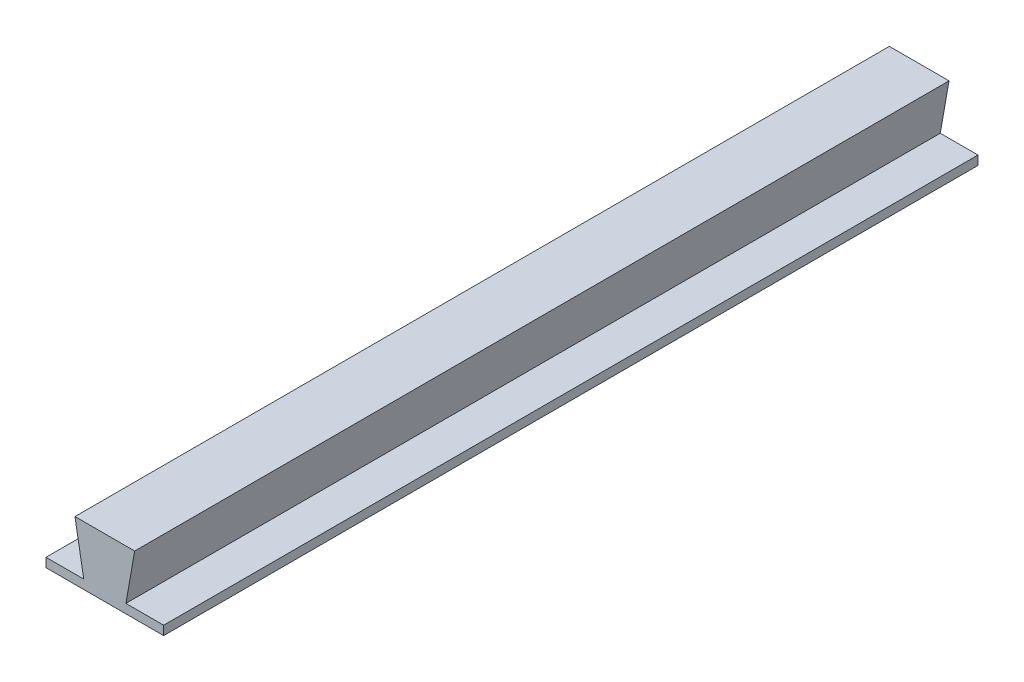
ISO-10303-21;
HEADER;
FILE_DESCRIPTION(('STEP AP214'),'2;1');
FILE_NAME('part.step','',(''),(''),'','','');
FILE_SCHEMA(('AUTOMOTIVE_DESIGN { 1 0 10303 214 1 1 1 1 }'));
ENDSEC;
DATA;
#1=APPLICATION_CONTEXT('core data for automotive mechanical design processes');
#2=APPLICATION_PROTOCOL_DEFINITION('international standard','automotive_design',2000,#1);
#3=PRODUCT_CONTEXT('',#1,'mechanical');
#4=PRODUCT('Part','Part','',(#3));
#5=PRODUCT_RELATED_PRODUCT_CATEGORY('part','',(#4));
#6=PRODUCT_DEFINITION_FORMATION('','',#4);
#7=PRODUCT_DEFINITION_CONTEXT('part definition',#1,'design');
#8=PRODUCT_DEFINITION('design','',#6,#7);
#9=PRODUCT_DEFINITION_SHAPE('','',#8);
#10=(LENGTH_UNIT() NAMED_UNIT(*) SI_UNIT(.MILLI.,.METRE.));
#11=(NAMED_UNIT(*) PLANE_ANGLE_UNIT() SI_UNIT($,.RADIAN.));
#12=(NAMED_UNIT(*) SI_UNIT($,.STERADIAN.) SOLID_ANGLE_UNIT());
#13=UNCERTAINTY_MEASURE_WITH_UNIT(LENGTH_MEASURE(1.E-05),#10,'distance_accuracy_value','');
#14=(GEOMETRIC_REPRESENTATION_CONTEXT(3) GLOBAL_UNCERTAINTY_ASSIGNED_CONTEXT((#13)) GLOBAL_UNIT_ASSIGNED_CONTEXT((#10,
#11,#12)) REPRESENTATION_CONTEXT('',''));
#15=CARTESIAN_POINT('',(0.,0.,0.));
#16=DIRECTION('',(0.,0.,1.));
#17=DIRECTION('',(1.,0.,0.));
#18=AXIS2_PLACEMENT_3D('',#15,#16,#17);
#19=CARTESIAN_POINT('',(-4.51987486030227,-0.796975887297212,180.));
#20=DIRECTION('',(-0.984807753012207,-0.173648177666934,0.));
#21=DIRECTION('',(0.173648177666934,-0.984807753012207,0.));
#22=AXIS2_PLACEMENT_3D('',#19,#20,#21);
#23=PLANE('',#22);
#24=DIRECTION('',(-0.173648177666934,0.984807753012207,0.));
#25=VECTOR('',#24,1.);
#26=CARTESIAN_POINT('',(-4.51987486030227,-0.796975887297212,0.));
#27=LINE('',#26,#25);
#28=CARTESIAN_POINT('',(-4.66040321220684,0.,0.));
#29=VERTEX_POINT('',#28);
#30=CARTESIAN_POINT('',(-6.6,11.,0.));
#31=VERTEX_POINT('',#30);
#32=EDGE_CURVE('E140',#29,#31,#27,.T.);
#33=ORIENTED_EDGE('',*,*,#32,.F.);
#34=DIRECTION('',(0.,0.,-1.));
#35=VECTOR('',#34,1.);
#36=CARTESIAN_POINT('',(-4.66040321220684,0.,180.));
#37=LINE('',#36,#35);
#38=CARTESIAN_POINT('',(-4.66040321220684,0.,180.));
#39=VERTEX_POINT('',#38);
#40=EDGE_CURVE('E11',#39,#29,#37,.T.);
#41=ORIENTED_EDGE('',*,*,#40,.F.);
#42=DIRECTION('',(-0.173648177666934,0.984807753012207,0.));
#43=VECTOR('',#42,1.);
#44=CARTESIAN_POINT('',(-4.51987486030227,-0.796975887297212,180.));
#45=LINE('',#44,#43);
#46=CARTESIAN_POINT('',(-6.6,11.,180.));
#47=VERTEX_POINT('',#46);
#48=EDGE_CURVE('E150',#39,#47,#45,.T.);
#49=ORIENTED_EDGE('',*,*,#48,.T.);
#50=DIRECTION('',(0.,0.,-1.));
#51=VECTOR('',#50,1.);
#52=CARTESIAN_POINT('',(-6.6,11.,180.));
#53=LINE('',#52,#51);
#54=EDGE_CURVE('E79',#47,#31,#53,.T.);
#55=ORIENTED_EDGE('',*,*,#54,.T.);
#56=EDGE_LOOP('',(#33,#41,#49,#55));
#57=FACE_BOUND('',#56,.T.);
#58=ADVANCED_FACE('F41',(#57),#23,.T.);
#59=CARTESIAN_POINT('',(4.51987486030227,-0.796975887297213,180.));
#60=DIRECTION('',(-0.984807753012207,0.173648177666934,0.));
#61=DIRECTION('',(-0.173648177666934,-0.984807753012208,0.));
#62=AXIS2_PLACEMENT_3D('',#59,#60,#61);
#63=PLANE('',#62);
#64=DIRECTION('',(0.173648177666934,0.984807753012208,0.));
#65=VECTOR('',#64,1.);
#66=CARTESIAN_POINT('',(4.51987486030227,-0.796975887297213,0.));
#67=LINE('',#66,#65);
#68=CARTESIAN_POINT('',(4.66040321220684,0.,0.));
#69=VERTEX_POINT('',#68);
#70=CARTESIAN_POINT('',(6.6,11.,0.));
#71=VERTEX_POINT('',#70);
#72=EDGE_CURVE('E72',#69,#71,#67,.T.);
#73=ORIENTED_EDGE('',*,*,#72,.T.);
#74=DIRECTION('',(0.,0.,-1.));
#75=VECTOR('',#74,1.);
#76=CARTESIAN_POINT('',(6.6,11.,180.));
#77=LINE('',#76,#75);
#78=CARTESIAN_POINT('',(6.6,11.,180.));
#79=VERTEX_POINT('',#78);
#80=EDGE_CURVE('E165',#79,#71,#77,.T.);
#81=ORIENTED_EDGE('',*,*,#80,.F.);
#82=DIRECTION('',(0.173648177666934,0.984807753012208,0.));
#83=VECTOR('',#82,1.);
#84=CARTESIAN_POINT('',(4.51987486030227,-0.796975887297213,180.));
#85=LINE('',#84,#83);
#86=CARTESIAN_POINT('',(4.66040321220684,0.,180.));
#87=VERTEX_POINT('',#86);
#88=EDGE_CURVE('E153',#87,#79,#85,.T.);
#89=ORIENTED_EDGE('',*,*,#88,.F.);
#90=DIRECTION('',(0.,0.,-1.));
#91=VECTOR('',#90,1.);
#92=CARTESIAN_POINT('',(4.66040321220684,0.,180.));
#93=LINE('',#92,#91);
#94=EDGE_CURVE('E50',#87,#69,#93,.T.);
#95=ORIENTED_EDGE('',*,*,#94,.T.);
#96=EDGE_LOOP('',(#73,#81,#89,#95));
#97=FACE_BOUND('',#96,.T.);
#98=ADVANCED_FACE('F169',(#97),#63,.F.);
#99=CARTESIAN_POINT('',(0.,11.,180.));
#100=DIRECTION('',(0.,-1.,0.));
#101=DIRECTION('',(1.,0.,0.));
#102=AXIS2_PLACEMENT_3D('',#99,#100,#101);
#103=PLANE('',#102);
#104=DIRECTION('',(-1.,0.,0.));
#105=VECTOR('',#104,1.);
#106=CARTESIAN_POINT('',(0.,11.,0.));
#107=LINE('',#106,#105);
#108=EDGE_CURVE('E154',#71,#31,#107,.T.);
#109=ORIENTED_EDGE('',*,*,#108,.T.);
#110=ORIENTED_EDGE('',*,*,#54,.F.);
#111=DIRECTION('',(-1.,0.,0.));
#112=VECTOR('',#111,1.);
#113=CARTESIAN_POINT('',(0.,11.,180.));
#114=LINE('',#113,#112);
#115=EDGE_CURVE('E58',#79,#47,#114,.T.);
#116=ORIENTED_EDGE('',*,*,#115,.F.);
#117=ORIENTED_EDGE('',*,*,#80,.T.);
#118=EDGE_LOOP('',(#109,#110,#116,#117));
#119=FACE_BOUND('',#118,.T.);
#120=ADVANCED_FACE('F221',(#119),#103,.F.);
#121=CARTESIAN_POINT('',(0.,0.,180.));
#122=DIRECTION('',(0.,0.,1.));
#123=DIRECTION('',(1.,0.,0.));
#124=AXIS2_PLACEMENT_3D('',#121,#122,#123);
#125=PLANE('',#124);
#126=ORIENTED_EDGE('',*,*,#48,.F.);
#127=DIRECTION('',(-1.,0.,0.));
#128=VECTOR('',#127,1.);
#129=CARTESIAN_POINT('',(-13.,0.,180.));
#130=LINE('',#129,#128);
#131=CARTESIAN_POINT('',(-13.,0.,180.));
#132=VERTEX_POINT('',#131);
#133=EDGE_CURVE('E198',#39,#132,#130,.T.);
#134=ORIENTED_EDGE('',*,*,#133,.T.);
#135=DIRECTION('',(0.,1.,0.));
#136=VECTOR('',#135,1.);
#137=CARTESIAN_POINT('',(-13.,-2.,180.));
#138=LINE('',#137,#136);
#139=CARTESIAN_POINT('',(-13.,-2.,180.));
#140=VERTEX_POINT('',#139);
#141=EDGE_CURVE('E119',#140,#132,#138,.T.);
#142=ORIENTED_EDGE('',*,*,#141,.F.);
#143=DIRECTION('',(-1.,0.,0.));
#144=VECTOR('',#143,1.);
#145=CARTESIAN_POINT('',(-13.,-2.,180.));
#146=LINE('',#145,#144);
#147=CARTESIAN_POINT('',(13.,-2.,180.));
#148=VERTEX_POINT('',#147);
#149=EDGE_CURVE('E111',#148,#140,#146,.T.);
#150=ORIENTED_EDGE('',*,*,#149,.F.);
#151=DIRECTION('',(0.,1.,0.));
#152=VECTOR('',#151,1.);
#153=CARTESIAN_POINT('',(13.,-2.,180.));
#154=LINE('',#153,#152);
#155=CARTESIAN_POINT('',(13.,0.,180.));
#156=VERTEX_POINT('',#155);
#157=EDGE_CURVE('E116',#148,#156,#154,.T.);
#158=ORIENTED_EDGE('',*,*,#157,.T.);
#159=EDGE_CURVE('E183',#156,#87,#130,.T.);
#160=ORIENTED_EDGE('',*,*,#159,.T.);
#161=ORIENTED_EDGE('',*,*,#88,.T.);
#162=ORIENTED_EDGE('',*,*,#115,.T.);
#163=EDGE_LOOP('',(#126,#134,#142,#150,#158,#160,#161,#162));
#164=FACE_BOUND('',#163,.T.);
#165=ADVANCED_FACE('F113',(#164),#125,.T.);
#166=CARTESIAN_POINT('',(0.,0.,0.));
#167=DIRECTION('',(0.,0.,1.));
#168=DIRECTION('',(1.,0.,0.));
#169=AXIS2_PLACEMENT_3D('',#166,#167,#168);
#170=PLANE('',#169);
#171=ORIENTED_EDGE('',*,*,#32,.T.);
#172=ORIENTED_EDGE('',*,*,#108,.F.);
#173=ORIENTED_EDGE('',*,*,#72,.F.);
#174=DIRECTION('',(1.,0.,0.));
#175=VECTOR('',#174,1.);
#176=CARTESIAN_POINT('',(-13.,0.,0.));
#177=LINE('',#176,#175);
#178=CARTESIAN_POINT('',(13.,0.,0.));
#179=VERTEX_POINT('',#178);
#180=EDGE_CURVE('E175',#69,#179,#177,.T.);
#181=ORIENTED_EDGE('',*,*,#180,.T.);
#182=DIRECTION('',(0.,1.,0.));
#183=VECTOR('',#182,1.);
#184=CARTESIAN_POINT('',(13.,-2.,0.));
#185=LINE('',#184,#183);
#186=CARTESIAN_POINT('',(13.,-2.,0.));
#187=VERTEX_POINT('',#186);
#188=EDGE_CURVE('E187',#187,#179,#185,.T.);
#189=ORIENTED_EDGE('',*,*,#188,.F.);
#190=DIRECTION('',(1.,0.,0.));
#191=VECTOR('',#190,1.);
#192=CARTESIAN_POINT('',(-13.,-2.,0.));
#193=LINE('',#192,#191);
#194=CARTESIAN_POINT('',(-13.,-2.,0.));
#195=VERTEX_POINT('',#194);
#196=EDGE_CURVE('E129',#195,#187,#193,.T.);
#197=ORIENTED_EDGE('',*,*,#196,.F.);
#198=DIRECTION('',(0.,1.,0.));
#199=VECTOR('',#198,1.);
#200=CARTESIAN_POINT('',(-13.,-2.,0.));
#201=LINE('',#200,#199);
#202=CARTESIAN_POINT('',(-13.,0.,0.));
#203=VERTEX_POINT('',#202);
#204=EDGE_CURVE('E146',#195,#203,#201,.T.);
#205=ORIENTED_EDGE('',*,*,#204,.T.);
#206=EDGE_CURVE('E134',#203,#29,#177,.T.);
#207=ORIENTED_EDGE('',*,*,#206,.T.);
#208=EDGE_LOOP('',(#171,#172,#173,#181,#189,#197,#205,#207));
#209=FACE_BOUND('',#208,.T.);
#210=ADVANCED_FACE('F174',(#209),#170,.F.);
#211=CARTESIAN_POINT('',(0.,0.,0.));
#212=DIRECTION('',(0.,1.,0.));
#213=DIRECTION('',(-1.,0.,0.));
#214=AXIS2_PLACEMENT_3D('',#211,#212,#213);
#215=PLANE('',#214);
#216=ORIENTED_EDGE('',*,*,#94,.F.);
#217=ORIENTED_EDGE('',*,*,#159,.F.);
#218=DIRECTION('',(0.,0.,1.));
#219=VECTOR('',#218,1.);
#220=CARTESIAN_POINT('',(13.,0.,0.));
#221=LINE('',#220,#219);
#222=EDGE_CURVE('E138',#179,#156,#221,.T.);
#223=ORIENTED_EDGE('',*,*,#222,.F.);
#224=ORIENTED_EDGE('',*,*,#180,.F.);
#225=EDGE_LOOP('',(#216,#217,#223,#224));
#226=FACE_BOUND('',#225,.T.);
#227=ADVANCED_FACE('F176',(#226),#215,.T.);
#228=CARTESIAN_POINT('',(13.,-2.,0.));
#229=DIRECTION('',(-1.,0.,0.));
#230=DIRECTION('',(0.,-1.,0.));
#231=AXIS2_PLACEMENT_3D('',#228,#229,#230);
#232=PLANE('',#231);
#233=ORIENTED_EDGE('',*,*,#222,.T.);
#234=ORIENTED_EDGE('',*,*,#157,.F.);
#235=DIRECTION('',(0.,0.,1.));
#236=VECTOR('',#235,1.);
#237=CARTESIAN_POINT('',(13.,-2.,0.));
#238=LINE('',#237,#236);
#239=EDGE_CURVE('E124',#187,#148,#238,.T.);
#240=ORIENTED_EDGE('',*,*,#239,.F.);
#241=ORIENTED_EDGE('',*,*,#188,.T.);
#242=EDGE_LOOP('',(#233,#234,#240,#241));
#243=FACE_BOUND('',#242,.T.);
#244=ADVANCED_FACE('F136',(#243),#232,.F.);
#245=CARTESIAN_POINT('',(-13.,-2.,0.));
#246=DIRECTION('',(1.,0.,0.));
#247=DIRECTION('',(0.,1.,0.));
#248=AXIS2_PLACEMENT_3D('',#245,#246,#247);
#249=PLANE('',#248);
#250=DIRECTION('',(0.,0.,-1.));
#251=VECTOR('',#250,1.);
#252=CARTESIAN_POINT('',(-13.,0.,0.));
#253=LINE('',#252,#251);
#254=EDGE_CURVE('E178',#132,#203,#253,.T.);
#255=ORIENTED_EDGE('',*,*,#254,.T.);
#256=ORIENTED_EDGE('',*,*,#204,.F.);
#257=DIRECTION('',(0.,0.,-1.));
#258=VECTOR('',#257,1.);
#259=CARTESIAN_POINT('',(-13.,-2.,0.));
#260=LINE('',#259,#258);
#261=EDGE_CURVE('E123',#140,#195,#260,.T.);
#262=ORIENTED_EDGE('',*,*,#261,.F.);
#263=ORIENTED_EDGE('',*,*,#141,.T.);
#264=EDGE_LOOP('',(#255,#256,#262,#263));
#265=FACE_BOUND('',#264,.T.);
#266=ADVANCED_FACE('F207',(#265),#249,.F.);
#267=CARTESIAN_POINT('',(0.,-2.,0.));
#268=DIRECTION('',(0.,1.,0.));
#269=DIRECTION('',(-1.,0.,0.));
#270=AXIS2_PLACEMENT_3D('',#267,#268,#269);
#271=PLANE('',#270);
#272=ORIENTED_EDGE('',*,*,#239,.T.);
#273=ORIENTED_EDGE('',*,*,#149,.T.);
#274=ORIENTED_EDGE('',*,*,#261,.T.);
#275=ORIENTED_EDGE('',*,*,#196,.T.);
#276=EDGE_LOOP('',(#272,#273,#274,#275));
#277=FACE_BOUND('',#276,.T.);
#278=ADVANCED_FACE('F127',(#277),#271,.F.);
#279=ORIENTED_EDGE('',*,*,#133,.F.);
#280=ORIENTED_EDGE('',*,*,#40,.T.);
#281=ORIENTED_EDGE('',*,*,#206,.F.);
#282=ORIENTED_EDGE('',*,*,#254,.F.);
#283=EDGE_LOOP('',(#279,#280,#281,#282));
#284=FACE_BOUND('',#283,.T.);
#285=ADVANCED_FACE('F197',(#284),#215,.T.);
#286=CLOSED_SHELL('',(#58,#98,#120,#165,#210,#227,#244,#266,#278,#285));
#287=MANIFOLD_SOLID_BREP('B2',#286);
#288=ADVANCED_BREP_SHAPE_REPRESENTATION('',(#18,#287),#14);
#289=SHAPE_DEFINITION_REPRESENTATION(#9,#288);
ENDSEC;
END-ISO-10303-21;
